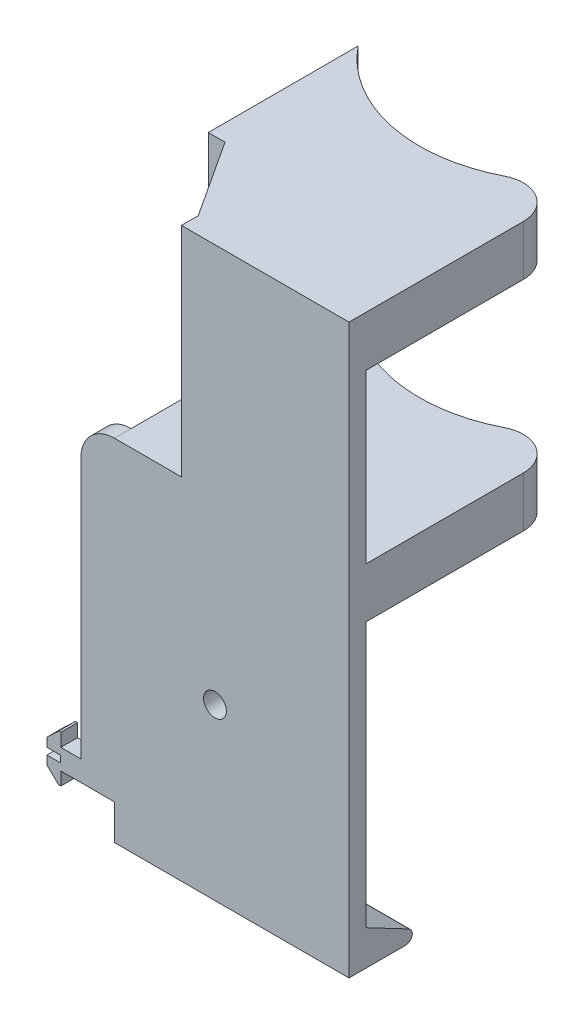
ISO-10303-21;
HEADER;
FILE_DESCRIPTION(('STEP AP214'),'2;1');
FILE_NAME('part.step','',(''),(''),'','','');
FILE_SCHEMA(('AUTOMOTIVE_DESIGN { 1 0 10303 214 1 1 1 1 }'));
ENDSEC;
DATA;
#1=APPLICATION_CONTEXT('core data for automotive mechanical design processes');
#2=APPLICATION_PROTOCOL_DEFINITION('international standard','automotive_design',2000,#1);
#3=PRODUCT_CONTEXT('',#1,'mechanical');
#4=PRODUCT('Part','Part','',(#3));
#5=PRODUCT_RELATED_PRODUCT_CATEGORY('part','',(#4));
#6=PRODUCT_DEFINITION_FORMATION('','',#4);
#7=PRODUCT_DEFINITION_CONTEXT('part definition',#1,'design');
#8=PRODUCT_DEFINITION('design','',#6,#7);
#9=PRODUCT_DEFINITION_SHAPE('','',#8);
#10=(LENGTH_UNIT() NAMED_UNIT(*) SI_UNIT(.MILLI.,.METRE.));
#11=(NAMED_UNIT(*) PLANE_ANGLE_UNIT() SI_UNIT($,.RADIAN.));
#12=(NAMED_UNIT(*) SI_UNIT($,.STERADIAN.) SOLID_ANGLE_UNIT());
#13=UNCERTAINTY_MEASURE_WITH_UNIT(LENGTH_MEASURE(1.E-05),#10,'distance_accuracy_value','');
#14=(GEOMETRIC_REPRESENTATION_CONTEXT(3) GLOBAL_UNCERTAINTY_ASSIGNED_CONTEXT((#13)) GLOBAL_UNIT_ASSIGNED_CONTEXT((#10,
#11,#12)) REPRESENTATION_CONTEXT('',''));
#15=CARTESIAN_POINT('',(0.,0.,0.));
#16=DIRECTION('',(0.,0.,1.));
#17=DIRECTION('',(1.,0.,0.));
#18=AXIS2_PLACEMENT_3D('',#15,#16,#17);
#19=CARTESIAN_POINT('',(0.,0.,-5.));
#20=DIRECTION('',(0.,0.,1.));
#21=DIRECTION('',(1.,0.,0.));
#22=AXIS2_PLACEMENT_3D('',#19,#20,#21);
#23=PLANE('',#22);
#24=DIRECTION('',(-1.,0.,0.));
#25=VECTOR('',#24,1.);
#26=CARTESIAN_POINT('',(95.0000000000001,140.95,-5.));
#27=LINE('',#26,#25);
#28=CARTESIAN_POINT('',(85.0000000000001,140.95,-5.));
#29=VERTEX_POINT('',#28);
#30=CARTESIAN_POINT('',(35.0000000000001,140.95,-5.));
#31=VERTEX_POINT('',#30);
#32=EDGE_CURVE('E318',#29,#31,#27,.T.);
#33=ORIENTED_EDGE('',*,*,#32,.F.);
#34=DIRECTION('',(0.,-1.,0.));
#35=VECTOR('',#34,1.);
#36=CARTESIAN_POINT('',(85.0000000000001,0.,-5.));
#37=LINE('',#36,#35);
#38=CARTESIAN_POINT('',(85.0000000000001,90.95,-5.));
#39=VERTEX_POINT('',#38);
#40=EDGE_CURVE('E543',#29,#39,#37,.T.);
#41=ORIENTED_EDGE('',*,*,#40,.T.);
#42=DIRECTION('',(-1.,0.,0.));
#43=VECTOR('',#42,1.);
#44=CARTESIAN_POINT('',(95.0000000000001,90.95,-4.99999999999999));
#45=LINE('',#44,#43);
#46=CARTESIAN_POINT('',(35.0000000000001,90.95,-5.));
#47=VERTEX_POINT('',#46);
#48=EDGE_CURVE('E319',#39,#47,#45,.T.);
#49=ORIENTED_EDGE('',*,*,#48,.T.);
#50=DIRECTION('',(0.,1.,0.));
#51=VECTOR('',#50,1.);
#52=CARTESIAN_POINT('',(35.0000000000001,90.95,-5.));
#53=LINE('',#52,#51);
#54=EDGE_CURVE('E308',#47,#31,#53,.T.);
#55=ORIENTED_EDGE('',*,*,#54,.T.);
#56=EDGE_LOOP('',(#33,#41,#49,#55));
#57=FACE_BOUND('',#56,.T.);
#58=ADVANCED_FACE('F39',(#57),#23,.F.);
#59=CARTESIAN_POINT('',(0.,-3.05,-5.));
#60=DIRECTION('',(0.,-1.,0.));
#61=DIRECTION('',(1.,0.,0.));
#62=AXIS2_PLACEMENT_3D('',#59,#60,#61);
#63=PLANE('',#62);
#64=DIRECTION('',(1.,0.,0.));
#65=VECTOR('',#64,1.);
#66=CARTESIAN_POINT('',(0.,-3.05,-5.));
#67=LINE('',#66,#65);
#68=CARTESIAN_POINT('',(-0.999999999999957,-3.05,-5.));
#69=VERTEX_POINT('',#68);
#70=CARTESIAN_POINT('',(15.0000000000001,-3.05,-5.));
#71=VERTEX_POINT('',#70);
#72=EDGE_CURVE('E387',#69,#71,#67,.T.);
#73=ORIENTED_EDGE('',*,*,#72,.T.);
#74=DIRECTION('',(0.,0.,-1.));
#75=VECTOR('',#74,1.);
#76=CARTESIAN_POINT('',(15.0000000000001,-3.05,0.));
#77=LINE('',#76,#75);
#78=CARTESIAN_POINT('',(15.0000000000001,-3.05,0.));
#79=VERTEX_POINT('',#78);
#80=EDGE_CURVE('E278',#79,#71,#77,.T.);
#81=ORIENTED_EDGE('',*,*,#80,.F.);
#82=DIRECTION('',(1.,0.,0.));
#83=VECTOR('',#82,1.);
#84=CARTESIAN_POINT('',(0.,-3.05,0.));
#85=LINE('',#84,#83);
#86=CARTESIAN_POINT('',(-0.999999999999957,-3.05,0.));
#87=VERTEX_POINT('',#86);
#88=EDGE_CURVE('E416',#87,#79,#85,.T.);
#89=ORIENTED_EDGE('',*,*,#88,.F.);
#90=DIRECTION('',(0.,0.,1.));
#91=VECTOR('',#90,1.);
#92=CARTESIAN_POINT('',(-0.999999999999957,-3.05,-5.));
#93=LINE('',#92,#91);
#94=EDGE_CURVE('E413',#69,#87,#93,.T.);
#95=ORIENTED_EDGE('',*,*,#94,.F.);
#96=EDGE_LOOP('',(#73,#81,#89,#95));
#97=FACE_BOUND('',#96,.T.);
#98=ADVANCED_FACE('F555',(#97),#63,.T.);
#99=CARTESIAN_POINT('',(45.0000000000009,37.0768697603299,-5.));
#100=DIRECTION('',(0.,0.,-1.));
#101=DIRECTION('',(-1.,0.,0.));
#102=AXIS2_PLACEMENT_3D('',#99,#100,#101);
#103=CIRCLE('',#102,3.4);
#104=CARTESIAN_POINT('',(41.6000000000009,37.0768697603299,-5.));
#105=VERTEX_POINT('',#104);
#106=EDGE_CURVE('E576',#105,#105,#103,.T.);
#107=ORIENTED_EDGE('',*,*,#106,.F.);
#108=EDGE_LOOP('',(#107));
#109=FACE_BOUND('',#108,.T.);
#110=DIRECTION('',(-1.,0.,0.));
#111=VECTOR('',#110,1.);
#112=CARTESIAN_POINT('',(0.,75.95,-5.));
#113=LINE('',#112,#111);
#114=CARTESIAN_POINT('',(85.0000000000001,75.95,-5.));
#115=VERTEX_POINT('',#114);
#116=CARTESIAN_POINT('',(15.0000000000001,75.95,-5.));
#117=VERTEX_POINT('',#116);
#118=EDGE_CURVE('E367',#115,#117,#113,.T.);
#119=ORIENTED_EDGE('',*,*,#118,.F.);
#120=CARTESIAN_POINT('',(85.0000000000001,-3.05000000000001,-5.));
#121=VERTEX_POINT('',#120);
#122=EDGE_CURVE('E506',#115,#121,#37,.T.);
#123=ORIENTED_EDGE('',*,*,#122,.T.);
#124=DIRECTION('',(-1.,0.,0.));
#125=VECTOR('',#124,1.);
#126=CARTESIAN_POINT('',(117.588713996153,-3.05000000000001,-5.));
#127=LINE('',#126,#125);
#128=EDGE_CURVE('E282',#121,#71,#127,.T.);
#129=ORIENTED_EDGE('',*,*,#128,.T.);
#130=ORIENTED_EDGE('',*,*,#72,.F.);
#131=DIRECTION('',(0.,1.,0.));
#132=VECTOR('',#131,1.);
#133=CARTESIAN_POINT('',(-0.999999999999989,0.,-5.));
#134=LINE('',#133,#132);
#135=CARTESIAN_POINT('',(-0.999999999999916,-6.95,-5.));
#136=VERTEX_POINT('',#135);
#137=EDGE_CURVE('E384',#136,#69,#134,.T.);
#138=ORIENTED_EDGE('',*,*,#137,.F.);
#139=DIRECTION('',(1.,0.,0.));
#140=VECTOR('',#139,1.);
#141=CARTESIAN_POINT('',(0.,-6.95,-5.));
#142=LINE('',#141,#140);
#143=CARTESIAN_POINT('',(-1.64108021115414,-6.95,-5.));
#144=VERTEX_POINT('',#143);
#145=EDGE_CURVE('E410',#144,#136,#142,.T.);
#146=ORIENTED_EDGE('',*,*,#145,.F.);
#147=DIRECTION('',(0.725421588273721,-0.68830481566413,0.));
#148=VECTOR('',#147,1.);
#149=CARTESIAN_POINT('',(-4.24769658577378,-4.47675322565298,-5.));
#150=LINE('',#149,#148);
#151=CARTESIAN_POINT('',(-5.15241498392364,-3.61832546401389,-5.));
#152=VERTEX_POINT('',#151);
#153=EDGE_CURVE('E407',#152,#144,#150,.T.);
#154=ORIENTED_EDGE('',*,*,#153,.F.);
#155=DIRECTION('',(0.,1.,0.));
#156=VECTOR('',#155,1.);
#157=CARTESIAN_POINT('',(-5.15241498392368,0.,-5.));
#158=LINE('',#157,#156);
#159=CARTESIAN_POINT('',(-5.15241498392366,-1.00000000000006,-5.));
#160=VERTEX_POINT('',#159);
#161=EDGE_CURVE('E404',#152,#160,#158,.T.);
#162=ORIENTED_EDGE('',*,*,#161,.T.);
#163=DIRECTION('',(1.,0.,0.));
#164=VECTOR('',#163,1.);
#165=CARTESIAN_POINT('',(0.,-1.00000000000006,-5.));
#166=LINE('',#165,#164);
#167=CARTESIAN_POINT('',(-1.15241498392369,-1.00000000000006,-5.));
#168=VERTEX_POINT('',#167);
#169=EDGE_CURVE('E357',#160,#168,#166,.T.);
#170=ORIENTED_EDGE('',*,*,#169,.T.);
#171=DIRECTION('',(0.,1.,0.));
#172=VECTOR('',#171,1.);
#173=CARTESIAN_POINT('',(-1.15241498392369,0.,-5.));
#174=LINE('',#173,#172);
#175=CARTESIAN_POINT('',(-1.15241498392369,0.999999999999944,-5.));
#176=VERTEX_POINT('',#175);
#177=EDGE_CURVE('E344',#168,#176,#174,.T.);
#178=ORIENTED_EDGE('',*,*,#177,.T.);
#179=DIRECTION('',(-1.,0.,0.));
#180=VECTOR('',#179,1.);
#181=CARTESIAN_POINT('',(0.,0.999999999999944,-5.));
#182=LINE('',#181,#180);
#183=CARTESIAN_POINT('',(-5.15241498392369,0.999999999999943,-5.));
#184=VERTEX_POINT('',#183);
#185=EDGE_CURVE('E354',#176,#184,#182,.T.);
#186=ORIENTED_EDGE('',*,*,#185,.T.);
#187=CARTESIAN_POINT('',(-5.15241498392371,3.61832546401378,-5.));
#188=VERTEX_POINT('',#187);
#189=EDGE_CURVE('E403',#184,#188,#158,.T.);
#190=ORIENTED_EDGE('',*,*,#189,.T.);
#191=DIRECTION('',(0.725421588273706,0.688304815664145,0.));
#192=VECTOR('',#191,1.);
#193=CARTESIAN_POINT('',(-4.24769658577387,4.47675322565289,-5.));
#194=LINE('',#193,#192);
#195=CARTESIAN_POINT('',(-1.64108021115429,6.94999999999997,-5.));
#196=VERTEX_POINT('',#195);
#197=EDGE_CURVE('E401',#188,#196,#194,.T.);
#198=ORIENTED_EDGE('',*,*,#197,.T.);
#199=DIRECTION('',(1.,0.,0.));
#200=VECTOR('',#199,1.);
#201=CARTESIAN_POINT('',(-1.50450167679732E-13,6.95,-5.));
#202=LINE('',#201,#200);
#203=CARTESIAN_POINT('',(-1.00000000000006,6.94999999999998,-5.));
#204=VERTEX_POINT('',#203);
#205=EDGE_CURVE('E399',#196,#204,#202,.T.);
#206=ORIENTED_EDGE('',*,*,#205,.T.);
#207=DIRECTION('',(0.,1.,0.));
#208=VECTOR('',#207,1.);
#209=CARTESIAN_POINT('',(-0.999999999999989,0.,-5.));
#210=LINE('',#209,#208);
#211=CARTESIAN_POINT('',(-1.00000000000002,3.04999999999999,-5.));
#212=VERTEX_POINT('',#211);
#213=EDGE_CURVE('E396',#212,#204,#210,.T.);
#214=ORIENTED_EDGE('',*,*,#213,.F.);
#215=DIRECTION('',(1.,0.,0.));
#216=VECTOR('',#215,1.);
#217=CARTESIAN_POINT('',(0.,3.04999999999998,-5.));
#218=LINE('',#217,#216);
#219=CARTESIAN_POINT('',(5.00000000000008,3.05,-5.));
#220=VERTEX_POINT('',#219);
#221=EDGE_CURVE('E394',#212,#220,#218,.T.);
#222=ORIENTED_EDGE('',*,*,#221,.T.);
#223=DIRECTION('',(0.,1.,0.));
#224=VECTOR('',#223,1.);
#225=CARTESIAN_POINT('',(5.00000000000008,0.,-5.));
#226=LINE('',#225,#224);
#227=CARTESIAN_POINT('',(5.00000000000008,80.95,-5.));
#228=VERTEX_POINT('',#227);
#229=EDGE_CURVE('E391',#220,#228,#226,.T.);
#230=ORIENTED_EDGE('',*,*,#229,.T.);
#231=CARTESIAN_POINT('',(15.0000000000001,80.95,-5.));
#232=DIRECTION('',(0.,0.,1.));
#233=DIRECTION('',(1.,0.,0.));
#234=AXIS2_PLACEMENT_3D('',#231,#232,#233);
#235=CIRCLE('',#234,10.);
#236=CARTESIAN_POINT('',(15.0000000000001,90.95,-5.));
#237=VERTEX_POINT('',#236);
#238=EDGE_CURVE('E480',#228,#237,#235,.F.);
#239=ORIENTED_EDGE('',*,*,#238,.T.);
#240=DIRECTION('',(0.,1.,0.));
#241=VECTOR('',#240,1.);
#242=CARTESIAN_POINT('',(15.0000000000001,75.95,-5.));
#243=LINE('',#242,#241);
#244=EDGE_CURVE('E377',#117,#237,#243,.T.);
#245=ORIENTED_EDGE('',*,*,#244,.F.);
#246=EDGE_LOOP('',(#119,#123,#129,#130,#138,#146,#154,#162,#170,#178,#186,#190,#198,#206,#214,
#222,#230,#239,#245));
#247=FACE_BOUND('',#246,.T.);
#248=ADVANCED_FACE('F557',(#109,#247),#23,.F.);
#249=CARTESIAN_POINT('',(5.00000000000008,0.,-5.));
#250=DIRECTION('',(1.,0.,0.));
#251=DIRECTION('',(0.,0.,-1.));
#252=AXIS2_PLACEMENT_3D('',#249,#250,#251);
#253=PLANE('',#252);
#254=DIRECTION('',(0.,1.,0.));
#255=VECTOR('',#254,1.);
#256=CARTESIAN_POINT('',(5.00000000000008,0.,0.));
#257=LINE('',#256,#255);
#258=CARTESIAN_POINT('',(5.00000000000008,3.05,0.));
#259=VERTEX_POINT('',#258);
#260=CARTESIAN_POINT('',(5.00000000000008,80.95,0.));
#261=VERTEX_POINT('',#260);
#262=EDGE_CURVE('E420',#259,#261,#257,.T.);
#263=ORIENTED_EDGE('',*,*,#262,.T.);
#264=DIRECTION('',(0.,0.,1.));
#265=VECTOR('',#264,1.);
#266=CARTESIAN_POINT('',(5.00000000000008,80.95,-5.));
#267=LINE('',#266,#265);
#268=EDGE_CURVE('E478',#261,#228,#267,.F.);
#269=ORIENTED_EDGE('',*,*,#268,.T.);
#270=ORIENTED_EDGE('',*,*,#229,.F.);
#271=DIRECTION('',(0.,0.,1.));
#272=VECTOR('',#271,1.);
#273=CARTESIAN_POINT('',(5.00000000000008,3.05,-5.));
#274=LINE('',#273,#272);
#275=EDGE_CURVE('E459',#220,#259,#274,.T.);
#276=ORIENTED_EDGE('',*,*,#275,.T.);
#277=EDGE_LOOP('',(#263,#269,#270,#276));
#278=FACE_BOUND('',#277,.T.);
#279=ADVANCED_FACE('F566',(#278),#253,.F.);
#280=CARTESIAN_POINT('',(50.0000000000001,75.95,-101.));
#281=DIRECTION('',(0.,1.,0.));
#282=DIRECTION('',(0.,0.,1.));
#283=AXIS2_PLACEMENT_3D('',#280,#281,#282);
#284=CYLINDRICAL_SURFACE('',#283,45.);
#285=CARTESIAN_POINT('',(50.0000000000001,90.95,-101.));
#286=DIRECTION('',(0.,-1.,0.));
#287=DIRECTION('',(0.,0.,-1.));
#288=AXIS2_PLACEMENT_3D('',#285,#286,#287);
#289=CIRCLE('',#288,45.);
#290=CARTESIAN_POINT('',(15.0000000000001,90.95,-72.7157287525381));
#291=VERTEX_POINT('',#290);
#292=CARTESIAN_POINT('',(70.4545454545455,90.95,-60.9174405726389));
#293=VERTEX_POINT('',#292);
#294=EDGE_CURVE('E331',#291,#293,#289,.F.);
#295=ORIENTED_EDGE('',*,*,#294,.T.);
#296=DIRECTION('',(0.,1.,0.));
#297=VECTOR('',#296,1.);
#298=CARTESIAN_POINT('',(70.4545454545455,75.95,-60.9174405726389));
#299=LINE('',#298,#297);
#300=CARTESIAN_POINT('',(70.4545454545455,75.95,-60.9174405726389));
#301=VERTEX_POINT('',#300);
#302=EDGE_CURVE('E491',#293,#301,#299,.F.);
#303=ORIENTED_EDGE('',*,*,#302,.T.);
#304=CARTESIAN_POINT('',(50.0000000000001,75.95,-101.));
#305=DIRECTION('',(0.,1.,0.));
#306=DIRECTION('',(0.,0.,1.));
#307=AXIS2_PLACEMENT_3D('',#304,#305,#306);
#308=CIRCLE('',#307,45.);
#309=CARTESIAN_POINT('',(15.0000000000001,75.95,-72.7157287525381));
#310=VERTEX_POINT('',#309);
#311=EDGE_CURVE('E361',#310,#301,#308,.T.);
#312=ORIENTED_EDGE('',*,*,#311,.F.);
#313=DIRECTION('',(0.,1.,0.));
#314=VECTOR('',#313,1.);
#315=CARTESIAN_POINT('',(15.0000000000001,75.95,-72.7157287525381));
#316=LINE('',#315,#314);
#317=EDGE_CURVE('E381',#310,#291,#316,.T.);
#318=ORIENTED_EDGE('',*,*,#317,.T.);
#319=EDGE_LOOP('',(#295,#303,#312,#318));
#320=FACE_BOUND('',#319,.T.);
#321=ADVANCED_FACE('F514',(#320),#284,.F.);
#322=CARTESIAN_POINT('',(15.0000000000001,75.95,0.));
#323=DIRECTION('',(-1.,0.,0.));
#324=DIRECTION('',(0.,0.,1.));
#325=AXIS2_PLACEMENT_3D('',#322,#323,#324);
#326=PLANE('',#325);
#327=DIRECTION('',(0.,0.,1.));
#328=VECTOR('',#327,1.);
#329=CARTESIAN_POINT('',(15.0000000000001,90.95,-5.));
#330=LINE('',#329,#328);
#331=EDGE_CURVE('E315',#291,#237,#330,.T.);
#332=ORIENTED_EDGE('',*,*,#331,.F.);
#333=ORIENTED_EDGE('',*,*,#317,.F.);
#334=DIRECTION('',(0.,0.,1.));
#335=VECTOR('',#334,1.);
#336=CARTESIAN_POINT('',(15.0000000000001,75.95,0.));
#337=LINE('',#336,#335);
#338=EDGE_CURVE('E364',#310,#117,#337,.T.);
#339=ORIENTED_EDGE('',*,*,#338,.T.);
#340=ORIENTED_EDGE('',*,*,#244,.T.);
#341=EDGE_LOOP('',(#332,#333,#339,#340));
#342=FACE_BOUND('',#341,.T.);
#343=ADVANCED_FACE('F516',(#342),#326,.T.);
#344=CARTESIAN_POINT('',(-5.15241498392368,0.,-5.));
#345=DIRECTION('',(1.,0.,0.));
#346=DIRECTION('',(0.,1.,0.));
#347=AXIS2_PLACEMENT_3D('',#344,#345,#346);
#348=PLANE('',#347);
#349=DIRECTION('',(0.,1.,0.));
#350=VECTOR('',#349,1.);
#351=CARTESIAN_POINT('',(-5.15241498392368,0.,0.));
#352=LINE('',#351,#350);
#353=CARTESIAN_POINT('',(-5.15241498392364,-3.61832546401389,0.));
#354=VERTEX_POINT('',#353);
#355=CARTESIAN_POINT('',(-5.15241498392366,-1.00000000000006,0.));
#356=VERTEX_POINT('',#355);
#357=EDGE_CURVE('E434',#354,#356,#352,.T.);
#358=ORIENTED_EDGE('',*,*,#357,.T.);
#359=DIRECTION('',(0.,0.,1.));
#360=VECTOR('',#359,1.);
#361=CARTESIAN_POINT('',(-5.15241498392366,-1.00000000000006,-72.7157287525381));
#362=LINE('',#361,#360);
#363=EDGE_CURVE('E342',#160,#356,#362,.T.);
#364=ORIENTED_EDGE('',*,*,#363,.F.);
#365=ORIENTED_EDGE('',*,*,#161,.F.);
#366=DIRECTION('',(0.,0.,1.));
#367=VECTOR('',#366,1.);
#368=CARTESIAN_POINT('',(-5.15241498392364,-3.61832546401389,-5.));
#369=LINE('',#368,#367);
#370=EDGE_CURVE('E447',#152,#354,#369,.T.);
#371=ORIENTED_EDGE('',*,*,#370,.T.);
#372=EDGE_LOOP('',(#358,#364,#365,#371));
#373=FACE_BOUND('',#372,.T.);
#374=ADVANCED_FACE('F618',(#373),#348,.F.);
#375=CARTESIAN_POINT('',(-0.999999999999989,0.,-5.));
#376=DIRECTION('',(1.,0.,0.));
#377=DIRECTION('',(0.,1.,0.));
#378=AXIS2_PLACEMENT_3D('',#375,#376,#377);
#379=PLANE('',#378);
#380=DIRECTION('',(0.,1.,0.));
#381=VECTOR('',#380,1.);
#382=CARTESIAN_POINT('',(-0.999999999999989,0.,0.));
#383=LINE('',#382,#381);
#384=CARTESIAN_POINT('',(-0.999999999999916,-6.95,0.));
#385=VERTEX_POINT('',#384);
#386=EDGE_CURVE('E380',#385,#87,#383,.T.);
#387=ORIENTED_EDGE('',*,*,#386,.F.);
#388=DIRECTION('',(0.,0.,1.));
#389=VECTOR('',#388,1.);
#390=CARTESIAN_POINT('',(-0.999999999999916,-6.95,-5.));
#391=LINE('',#390,#389);
#392=EDGE_CURVE('E442',#136,#385,#391,.T.);
#393=ORIENTED_EDGE('',*,*,#392,.F.);
#394=ORIENTED_EDGE('',*,*,#137,.T.);
#395=ORIENTED_EDGE('',*,*,#94,.T.);
#396=EDGE_LOOP('',(#387,#393,#394,#395));
#397=FACE_BOUND('',#396,.T.);
#398=ADVANCED_FACE('F630',(#397),#379,.T.);
#399=CARTESIAN_POINT('',(0.,-6.95,-5.));
#400=DIRECTION('',(0.,-1.,0.));
#401=DIRECTION('',(0.,0.,-1.));
#402=AXIS2_PLACEMENT_3D('',#399,#400,#401);
#403=PLANE('',#402);
#404=DIRECTION('',(1.,0.,0.));
#405=VECTOR('',#404,1.);
#406=CARTESIAN_POINT('',(0.,-6.95,0.));
#407=LINE('',#406,#405);
#408=CARTESIAN_POINT('',(-1.64108021115414,-6.95,0.));
#409=VERTEX_POINT('',#408);
#410=EDGE_CURVE('E388',#409,#385,#407,.T.);
#411=ORIENTED_EDGE('',*,*,#410,.F.);
#412=DIRECTION('',(0.,0.,1.));
#413=VECTOR('',#412,1.);
#414=CARTESIAN_POINT('',(-1.64108021115414,-6.95,-5.));
#415=LINE('',#414,#413);
#416=EDGE_CURVE('E445',#144,#409,#415,.T.);
#417=ORIENTED_EDGE('',*,*,#416,.F.);
#418=ORIENTED_EDGE('',*,*,#145,.T.);
#419=ORIENTED_EDGE('',*,*,#392,.T.);
#420=EDGE_LOOP('',(#411,#417,#418,#419));
#421=FACE_BOUND('',#420,.T.);
#422=ADVANCED_FACE('F626',(#421),#403,.T.);
#423=CARTESIAN_POINT('',(-4.24769658577378,-4.47675322565298,-5.));
#424=DIRECTION('',(-0.68830481566413,-0.725421588273721,0.));
#425=DIRECTION('',(0.725421588273721,-0.68830481566413,0.));
#426=AXIS2_PLACEMENT_3D('',#423,#424,#425);
#427=PLANE('',#426);
#428=DIRECTION('',(0.725421588273721,-0.68830481566413,0.));
#429=VECTOR('',#428,1.);
#430=CARTESIAN_POINT('',(-4.24769658577378,-4.47675322565298,0.));
#431=LINE('',#430,#429);
#432=EDGE_CURVE('E437',#354,#409,#431,.T.);
#433=ORIENTED_EDGE('',*,*,#432,.F.);
#434=ORIENTED_EDGE('',*,*,#370,.F.);
#435=ORIENTED_EDGE('',*,*,#153,.T.);
#436=ORIENTED_EDGE('',*,*,#416,.T.);
#437=EDGE_LOOP('',(#433,#434,#435,#436));
#438=FACE_BOUND('',#437,.T.);
#439=ADVANCED_FACE('F622',(#438),#427,.T.);
#440=ORIENTED_EDGE('',*,*,#189,.F.);
#441=DIRECTION('',(0.,0.,1.));
#442=VECTOR('',#441,1.);
#443=CARTESIAN_POINT('',(-5.15241498392369,0.999999999999943,-72.7157287525381));
#444=LINE('',#443,#442);
#445=CARTESIAN_POINT('',(-5.15241498392369,0.999999999999943,0.));
#446=VERTEX_POINT('',#445);
#447=EDGE_CURVE('E345',#184,#446,#444,.T.);
#448=ORIENTED_EDGE('',*,*,#447,.T.);
#449=CARTESIAN_POINT('',(-5.15241498392371,3.61832546401378,0.));
#450=VERTEX_POINT('',#449);
#451=EDGE_CURVE('E433',#446,#450,#352,.T.);
#452=ORIENTED_EDGE('',*,*,#451,.T.);
#453=DIRECTION('',(0.,0.,1.));
#454=VECTOR('',#453,1.);
#455=CARTESIAN_POINT('',(-5.15241498392371,3.61832546401378,-5.));
#456=LINE('',#455,#454);
#457=EDGE_CURVE('E449',#188,#450,#456,.T.);
#458=ORIENTED_EDGE('',*,*,#457,.F.);
#459=EDGE_LOOP('',(#440,#448,#452,#458));
#460=FACE_BOUND('',#459,.T.);
#461=ADVANCED_FACE('F603',(#460),#348,.F.);
#462=CARTESIAN_POINT('',(-4.24769658577387,4.47675322565289,-5.));
#463=DIRECTION('',(0.688304815664145,-0.725421588273706,0.));
#464=DIRECTION('',(0.725421588273706,0.688304815664145,0.));
#465=AXIS2_PLACEMENT_3D('',#462,#463,#464);
#466=PLANE('',#465);
#467=DIRECTION('',(0.725421588273706,0.688304815664145,0.));
#468=VECTOR('',#467,1.);
#469=CARTESIAN_POINT('',(-4.24769658577387,4.47675322565289,0.));
#470=LINE('',#469,#468);
#471=CARTESIAN_POINT('',(-1.64108021115429,6.94999999999997,0.));
#472=VERTEX_POINT('',#471);
#473=EDGE_CURVE('E431',#450,#472,#470,.T.);
#474=ORIENTED_EDGE('',*,*,#473,.T.);
#475=DIRECTION('',(0.,0.,1.));
#476=VECTOR('',#475,1.);
#477=CARTESIAN_POINT('',(-1.64108021115429,6.94999999999997,-5.));
#478=LINE('',#477,#476);
#479=EDGE_CURVE('E452',#196,#472,#478,.T.);
#480=ORIENTED_EDGE('',*,*,#479,.F.);
#481=ORIENTED_EDGE('',*,*,#197,.F.);
#482=ORIENTED_EDGE('',*,*,#457,.T.);
#483=EDGE_LOOP('',(#474,#480,#481,#482));
#484=FACE_BOUND('',#483,.T.);
#485=ADVANCED_FACE('F598',(#484),#466,.F.);
#486=CARTESIAN_POINT('',(-1.50450167679732E-13,6.95,-5.));
#487=DIRECTION('',(0.,-1.,0.));
#488=DIRECTION('',(1.,0.,0.));
#489=AXIS2_PLACEMENT_3D('',#486,#487,#488);
#490=PLANE('',#489);
#491=DIRECTION('',(1.,0.,0.));
#492=VECTOR('',#491,1.);
#493=CARTESIAN_POINT('',(-1.50450167679732E-13,6.95,0.));
#494=LINE('',#493,#492);
#495=CARTESIAN_POINT('',(-1.00000000000006,6.94999999999998,0.));
#496=VERTEX_POINT('',#495);
#497=EDGE_CURVE('E428',#472,#496,#494,.T.);
#498=ORIENTED_EDGE('',*,*,#497,.T.);
#499=DIRECTION('',(0.,0.,1.));
#500=VECTOR('',#499,1.);
#501=CARTESIAN_POINT('',(-1.00000000000006,6.94999999999998,-5.));
#502=LINE('',#501,#500);
#503=EDGE_CURVE('E455',#204,#496,#502,.T.);
#504=ORIENTED_EDGE('',*,*,#503,.F.);
#505=ORIENTED_EDGE('',*,*,#205,.F.);
#506=ORIENTED_EDGE('',*,*,#479,.T.);
#507=EDGE_LOOP('',(#498,#504,#505,#506));
#508=FACE_BOUND('',#507,.T.);
#509=ADVANCED_FACE('F592',(#508),#490,.F.);
#510=CARTESIAN_POINT('',(-0.999999999999989,0.,-5.));
#511=DIRECTION('',(1.,0.,0.));
#512=DIRECTION('',(0.,1.,0.));
#513=AXIS2_PLACEMENT_3D('',#510,#511,#512);
#514=PLANE('',#513);
#515=DIRECTION('',(0.,1.,0.));
#516=VECTOR('',#515,1.);
#517=CARTESIAN_POINT('',(-0.999999999999989,0.,0.));
#518=LINE('',#517,#516);
#519=CARTESIAN_POINT('',(-1.00000000000002,3.04999999999999,0.));
#520=VERTEX_POINT('',#519);
#521=EDGE_CURVE('E425',#520,#496,#518,.T.);
#522=ORIENTED_EDGE('',*,*,#521,.F.);
#523=DIRECTION('',(0.,0.,1.));
#524=VECTOR('',#523,1.);
#525=CARTESIAN_POINT('',(-1.00000000000002,3.04999999999999,-5.));
#526=LINE('',#525,#524);
#527=EDGE_CURVE('E457',#212,#520,#526,.T.);
#528=ORIENTED_EDGE('',*,*,#527,.F.);
#529=ORIENTED_EDGE('',*,*,#213,.T.);
#530=ORIENTED_EDGE('',*,*,#503,.T.);
#531=EDGE_LOOP('',(#522,#528,#529,#530));
#532=FACE_BOUND('',#531,.T.);
#533=ADVANCED_FACE('F586',(#532),#514,.T.);
#534=CARTESIAN_POINT('',(0.,3.04999999999998,-5.));
#535=DIRECTION('',(0.,-1.,0.));
#536=DIRECTION('',(1.,0.,0.));
#537=AXIS2_PLACEMENT_3D('',#534,#535,#536);
#538=PLANE('',#537);
#539=DIRECTION('',(1.,0.,0.));
#540=VECTOR('',#539,1.);
#541=CARTESIAN_POINT('',(0.,3.04999999999998,0.));
#542=LINE('',#541,#540);
#543=EDGE_CURVE('E423',#520,#259,#542,.T.);
#544=ORIENTED_EDGE('',*,*,#543,.T.);
#545=ORIENTED_EDGE('',*,*,#275,.F.);
#546=ORIENTED_EDGE('',*,*,#221,.F.);
#547=ORIENTED_EDGE('',*,*,#527,.T.);
#548=EDGE_LOOP('',(#544,#545,#546,#547));
#549=FACE_BOUND('',#548,.T.);
#550=ADVANCED_FACE('F660',(#549),#538,.F.);
#551=CARTESIAN_POINT('',(0.,155.95,-5.));
#552=DIRECTION('',(0.,-1.,0.));
#553=DIRECTION('',(0.,0.,-1.));
#554=AXIS2_PLACEMENT_3D('',#551,#552,#553);
#555=PLANE('',#554);
#556=DIRECTION('',(0.,0.,1.));
#557=VECTOR('',#556,1.);
#558=CARTESIAN_POINT('',(85.0000000000001,155.95,0.));
#559=LINE('',#558,#557);
#560=CARTESIAN_POINT('',(85.0000000000001,155.95,-52.0102051443365));
#561=VERTEX_POINT('',#560);
#562=CARTESIAN_POINT('',(85.0000000000001,155.95,0.));
#563=VERTEX_POINT('',#562);
#564=EDGE_CURVE('E256',#561,#563,#559,.T.);
#565=ORIENTED_EDGE('',*,*,#564,.F.);
#566=CARTESIAN_POINT('',(75.0000000000001,155.95,-52.0102051443365));
#567=DIRECTION('',(0.,-1.,0.));
#568=DIRECTION('',(0.,0.,-1.));
#569=AXIS2_PLACEMENT_3D('',#566,#567,#568);
#570=CIRCLE('',#569,10.);
#571=CARTESIAN_POINT('',(70.4545454545455,155.95,-60.9174405726389));
#572=VERTEX_POINT('',#571);
#573=EDGE_CURVE('E61',#561,#572,#570,.F.);
#574=ORIENTED_EDGE('',*,*,#573,.T.);
#575=CARTESIAN_POINT('',(50.0000000000001,155.95,-101.));
#576=DIRECTION('',(0.,1.,0.));
#577=DIRECTION('',(0.,0.,1.));
#578=AXIS2_PLACEMENT_3D('',#575,#576,#577);
#579=CIRCLE('',#578,45.);
#580=CARTESIAN_POINT('',(15.0000000000001,155.95,-72.7157287525381));
#581=VERTEX_POINT('',#580);
#582=EDGE_CURVE('E360',#581,#572,#579,.T.);
#583=ORIENTED_EDGE('',*,*,#582,.F.);
#584=DIRECTION('',(0.,0.,1.));
#585=VECTOR('',#584,1.);
#586=CARTESIAN_POINT('',(15.0000000000001,155.95,0.));
#587=LINE('',#586,#585);
#588=CARTESIAN_POINT('',(15.0000000000001,155.95,-28.));
#589=VERTEX_POINT('',#588);
#590=EDGE_CURVE('E373',#581,#589,#587,.T.);
#591=ORIENTED_EDGE('',*,*,#590,.T.);
#592=DIRECTION('',(-1.,0.,0.));
#593=VECTOR('',#592,1.);
#594=CARTESIAN_POINT('',(20.0000000000001,155.95,-28.));
#595=LINE('',#594,#593);
#596=CARTESIAN_POINT('',(20.0000000000001,155.95,-28.));
#597=VERTEX_POINT('',#596);
#598=EDGE_CURVE('E292',#597,#589,#595,.T.);
#599=ORIENTED_EDGE('',*,*,#598,.F.);
#600=DIRECTION('',(-0.546267780546923,0.,-0.837610596838614));
#601=VECTOR('',#600,1.);
#602=CARTESIAN_POINT('',(35.0000000000001,155.95,-5.));
#603=LINE('',#602,#601);
#604=CARTESIAN_POINT('',(35.0000000000001,155.95,-5.));
#605=VERTEX_POINT('',#604);
#606=EDGE_CURVE('E298',#605,#597,#603,.T.);
#607=ORIENTED_EDGE('',*,*,#606,.F.);
#608=DIRECTION('',(0.,0.,-1.));
#609=VECTOR('',#608,1.);
#610=CARTESIAN_POINT('',(35.0000000000001,155.95,0.));
#611=LINE('',#610,#609);
#612=CARTESIAN_POINT('',(35.0000000000001,155.95,0.));
#613=VERTEX_POINT('',#612);
#614=EDGE_CURVE('E288',#613,#605,#611,.T.);
#615=ORIENTED_EDGE('',*,*,#614,.F.);
#616=DIRECTION('',(1.,0.,0.));
#617=VECTOR('',#616,1.);
#618=CARTESIAN_POINT('',(0.,155.95,0.));
#619=LINE('',#618,#617);
#620=EDGE_CURVE('E418',#613,#563,#619,.T.);
#621=ORIENTED_EDGE('',*,*,#620,.T.);
#622=EDGE_LOOP('',(#565,#574,#583,#591,#599,#607,#615,#621));
#623=FACE_BOUND('',#622,.T.);
#624=ADVANCED_FACE('F530',(#623),#555,.F.);
#625=CARTESIAN_POINT('',(0.,0.,0.));
#626=DIRECTION('',(0.,0.,1.));
#627=DIRECTION('',(1.,0.,0.));
#628=AXIS2_PLACEMENT_3D('',#625,#626,#627);
#629=PLANE('',#628);
#630=CARTESIAN_POINT('',(45.0000000000009,37.0768697603299,0.));
#631=DIRECTION('',(0.,0.,-1.));
#632=DIRECTION('',(-1.,0.,0.));
#633=AXIS2_PLACEMENT_3D('',#630,#631,#632);
#634=CIRCLE('',#633,3.4);
#635=CARTESIAN_POINT('',(41.6000000000009,37.0768697603299,0.));
#636=VERTEX_POINT('',#635);
#637=EDGE_CURVE('E271',#636,#636,#634,.T.);
#638=ORIENTED_EDGE('',*,*,#637,.T.);
#639=EDGE_LOOP('',(#638));
#640=FACE_BOUND('',#639,.T.);
#641=DIRECTION('',(0.,1.,0.));
#642=VECTOR('',#641,1.);
#643=CARTESIAN_POINT('',(85.0000000000001,-13.55,0.));
#644=LINE('',#643,#642);
#645=CARTESIAN_POINT('',(85.0000000000001,-13.55,0.));
#646=VERTEX_POINT('',#645);
#647=EDGE_CURVE('E249',#646,#563,#644,.T.);
#648=ORIENTED_EDGE('',*,*,#647,.T.);
#649=ORIENTED_EDGE('',*,*,#620,.F.);
#650=DIRECTION('',(0.,1.,0.));
#651=VECTOR('',#650,1.);
#652=CARTESIAN_POINT('',(35.0000000000001,90.95,0.));
#653=LINE('',#652,#651);
#654=CARTESIAN_POINT('',(35.0000000000001,90.95,0.));
#655=VERTEX_POINT('',#654);
#656=EDGE_CURVE('E295',#655,#613,#653,.T.);
#657=ORIENTED_EDGE('',*,*,#656,.F.);
#658=DIRECTION('',(1.,0.,0.));
#659=VECTOR('',#658,1.);
#660=CARTESIAN_POINT('',(5.00000000000008,90.95,0.));
#661=LINE('',#660,#659);
#662=CARTESIAN_POINT('',(15.0000000000001,90.95,0.));
#663=VERTEX_POINT('',#662);
#664=EDGE_CURVE('E289',#663,#655,#661,.T.);
#665=ORIENTED_EDGE('',*,*,#664,.F.);
#666=CARTESIAN_POINT('',(15.0000000000001,80.95,0.));
#667=DIRECTION('',(0.,0.,1.));
#668=DIRECTION('',(1.,0.,0.));
#669=AXIS2_PLACEMENT_3D('',#666,#667,#668);
#670=CIRCLE('',#669,10.);
#671=EDGE_CURVE('E476',#663,#261,#670,.T.);
#672=ORIENTED_EDGE('',*,*,#671,.T.);
#673=ORIENTED_EDGE('',*,*,#262,.F.);
#674=ORIENTED_EDGE('',*,*,#543,.F.);
#675=ORIENTED_EDGE('',*,*,#521,.T.);
#676=ORIENTED_EDGE('',*,*,#497,.F.);
#677=ORIENTED_EDGE('',*,*,#473,.F.);
#678=ORIENTED_EDGE('',*,*,#451,.F.);
#679=DIRECTION('',(-1.,0.,0.));
#680=VECTOR('',#679,1.);
#681=CARTESIAN_POINT('',(-1.15241498392369,0.999999999999944,0.));
#682=LINE('',#681,#680);
#683=CARTESIAN_POINT('',(-1.15241498392369,0.999999999999944,0.));
#684=VERTEX_POINT('',#683);
#685=EDGE_CURVE('E339',#684,#446,#682,.T.);
#686=ORIENTED_EDGE('',*,*,#685,.F.);
#687=DIRECTION('',(0.,1.,0.));
#688=VECTOR('',#687,1.);
#689=CARTESIAN_POINT('',(-1.15241498392369,-1.00000000000006,0.));
#690=LINE('',#689,#688);
#691=CARTESIAN_POINT('',(-1.15241498392369,-1.00000000000006,0.));
#692=VERTEX_POINT('',#691);
#693=EDGE_CURVE('E336',#692,#684,#690,.T.);
#694=ORIENTED_EDGE('',*,*,#693,.F.);
#695=DIRECTION('',(1.,0.,0.));
#696=VECTOR('',#695,1.);
#697=CARTESIAN_POINT('',(-5.15241498392366,-1.00000000000006,0.));
#698=LINE('',#697,#696);
#699=EDGE_CURVE('E334',#356,#692,#698,.T.);
#700=ORIENTED_EDGE('',*,*,#699,.F.);
#701=ORIENTED_EDGE('',*,*,#357,.F.);
#702=ORIENTED_EDGE('',*,*,#432,.T.);
#703=ORIENTED_EDGE('',*,*,#410,.T.);
#704=ORIENTED_EDGE('',*,*,#386,.T.);
#705=ORIENTED_EDGE('',*,*,#88,.T.);
#706=DIRECTION('',(0.,1.,0.));
#707=VECTOR('',#706,1.);
#708=CARTESIAN_POINT('',(15.0000000000001,-13.55,0.));
#709=LINE('',#708,#707);
#710=CARTESIAN_POINT('',(15.0000000000001,-13.55,0.));
#711=VERTEX_POINT('',#710);
#712=EDGE_CURVE('E275',#711,#79,#709,.T.);
#713=ORIENTED_EDGE('',*,*,#712,.F.);
#714=DIRECTION('',(-1.,0.,0.));
#715=VECTOR('',#714,1.);
#716=CARTESIAN_POINT('',(95.0000000000001,-13.55,0.));
#717=LINE('',#716,#715);
#718=EDGE_CURVE('E267',#646,#711,#717,.T.);
#719=ORIENTED_EDGE('',*,*,#718,.F.);
#720=EDGE_LOOP('',(#648,#649,#657,#665,#672,#673,#674,#675,#676,#677,#678,#686,#694,#700,#701,
#702,#703,#704,#705,#713,#719));
#721=FACE_BOUND('',#720,.T.);
#722=ADVANCED_FACE('F273',(#640,#721),#629,.T.);
#723=ORIENTED_EDGE('',*,*,#582,.T.);
#724=DIRECTION('',(0.,1.,0.));
#725=VECTOR('',#724,1.);
#726=CARTESIAN_POINT('',(70.4545454545455,75.95,-60.9174405726389));
#727=LINE('',#726,#725);
#728=CARTESIAN_POINT('',(70.4545454545455,140.95,-60.9174405726389));
#729=VERTEX_POINT('',#728);
#730=EDGE_CURVE('E47',#572,#729,#727,.F.);
#731=ORIENTED_EDGE('',*,*,#730,.T.);
#732=CARTESIAN_POINT('',(50.0000000000001,140.95,-101.));
#733=DIRECTION('',(0.,1.,0.));
#734=DIRECTION('',(0.,0.,1.));
#735=AXIS2_PLACEMENT_3D('',#732,#733,#734);
#736=CIRCLE('',#735,45.);
#737=CARTESIAN_POINT('',(15.0000000000001,140.95,-72.7157287525381));
#738=VERTEX_POINT('',#737);
#739=EDGE_CURVE('E327',#729,#738,#736,.F.);
#740=ORIENTED_EDGE('',*,*,#739,.T.);
#741=EDGE_CURVE('E371',#738,#581,#316,.T.);
#742=ORIENTED_EDGE('',*,*,#741,.T.);
#743=EDGE_LOOP('',(#723,#731,#740,#742));
#744=FACE_BOUND('',#743,.T.);
#745=ADVANCED_FACE('F655',(#744),#284,.F.);
#746=CARTESIAN_POINT('',(85.0000000000001,75.95,0.));
#747=DIRECTION('',(-1.,0.,0.));
#748=DIRECTION('',(0.,0.,1.));
#749=AXIS2_PLACEMENT_3D('',#746,#747,#748);
#750=PLANE('',#749);
#751=DIRECTION('',(0.,0.,1.));
#752=VECTOR('',#751,1.);
#753=CARTESIAN_POINT('',(85.0000000000001,75.95,0.));
#754=LINE('',#753,#752);
#755=CARTESIAN_POINT('',(85.0000000000001,75.95,-52.0102051443365));
#756=VERTEX_POINT('',#755);
#757=EDGE_CURVE('E369',#756,#115,#754,.T.);
#758=ORIENTED_EDGE('',*,*,#757,.F.);
#759=DIRECTION('',(0.,1.,0.));
#760=VECTOR('',#759,1.);
#761=CARTESIAN_POINT('',(85.0000000000001,75.95,-52.0102051443365));
#762=LINE('',#761,#760);
#763=CARTESIAN_POINT('',(85.0000000000001,90.95,-52.0102051443365));
#764=VERTEX_POINT('',#763);
#765=EDGE_CURVE('E486',#756,#764,#762,.T.);
#766=ORIENTED_EDGE('',*,*,#765,.T.);
#767=DIRECTION('',(0.,0.,1.));
#768=VECTOR('',#767,1.);
#769=CARTESIAN_POINT('',(85.0000000000001,90.95,0.));
#770=LINE('',#769,#768);
#771=EDGE_CURVE('E329',#764,#39,#770,.T.);
#772=ORIENTED_EDGE('',*,*,#771,.T.);
#773=ORIENTED_EDGE('',*,*,#40,.F.);
#774=DIRECTION('',(0.,0.,-1.));
#775=VECTOR('',#774,1.);
#776=CARTESIAN_POINT('',(85.0000000000001,140.95,0.));
#777=LINE('',#776,#775);
#778=CARTESIAN_POINT('',(85.0000000000001,140.95,-52.0102051443365));
#779=VERTEX_POINT('',#778);
#780=EDGE_CURVE('E322',#29,#779,#777,.T.);
#781=ORIENTED_EDGE('',*,*,#780,.T.);
#782=DIRECTION('',(0.,1.,0.));
#783=VECTOR('',#782,1.);
#784=CARTESIAN_POINT('',(85.0000000000001,75.95,-52.0102051443365));
#785=LINE('',#784,#783);
#786=EDGE_CURVE('E484',#779,#561,#785,.T.);
#787=ORIENTED_EDGE('',*,*,#786,.T.);
#788=ORIENTED_EDGE('',*,*,#564,.T.);
#789=ORIENTED_EDGE('',*,*,#647,.F.);
#790=DIRECTION('',(0.,0.,1.));
#791=VECTOR('',#790,1.);
#792=CARTESIAN_POINT('',(85.0000000000001,-13.55,-72.7157287525381));
#793=LINE('',#792,#791);
#794=CARTESIAN_POINT('',(85.0000000000001,-13.55,-16.8878640007328));
#795=VERTEX_POINT('',#794);
#796=EDGE_CURVE('E253',#795,#646,#793,.T.);
#797=ORIENTED_EDGE('',*,*,#796,.F.);
#798=CARTESIAN_POINT('',(85.0000000000001,-11.55,-16.8878640007328));
#799=DIRECTION('',(-1.,0.,0.));
#800=DIRECTION('',(0.,0.,1.));
#801=AXIS2_PLACEMENT_3D('',#798,#799,#800);
#802=CIRCLE('',#801,2.);
#803=CARTESIAN_POINT('',(85.0000000000001,-9.77920419432412,-17.8175317987126));
#804=VERTEX_POINT('',#803);
#805=EDGE_CURVE('E482',#795,#804,#802,.F.);
#806=ORIENTED_EDGE('',*,*,#805,.T.);
#807=DIRECTION('',(0.,0.46483389898992,0.885397902837944));
#808=VECTOR('',#807,1.);
#809=CARTESIAN_POINT('',(85.0000000000001,-3.05000000000001,-5.));
#810=LINE('',#809,#808);
#811=EDGE_CURVE('E261',#804,#121,#810,.T.);
#812=ORIENTED_EDGE('',*,*,#811,.T.);
#813=ORIENTED_EDGE('',*,*,#122,.F.);
#814=EDGE_LOOP('',(#758,#766,#772,#773,#781,#787,#788,#789,#797,#806,#812,#813));
#815=FACE_BOUND('',#814,.T.);
#816=ADVANCED_FACE('F252',(#815),#750,.F.);
#817=DIRECTION('',(0.,1.,0.));
#818=VECTOR('',#817,1.);
#819=CARTESIAN_POINT('',(15.0000000000001,90.95,-28.));
#820=LINE('',#819,#818);
#821=CARTESIAN_POINT('',(15.0000000000001,140.95,-28.));
#822=VERTEX_POINT('',#821);
#823=EDGE_CURVE('E302',#822,#589,#820,.T.);
#824=ORIENTED_EDGE('',*,*,#823,.T.);
#825=ORIENTED_EDGE('',*,*,#590,.F.);
#826=ORIENTED_EDGE('',*,*,#741,.F.);
#827=DIRECTION('',(0.,0.,-1.));
#828=VECTOR('',#827,1.);
#829=CARTESIAN_POINT('',(15.0000000000001,140.95,-5.));
#830=LINE('',#829,#828);
#831=EDGE_CURVE('E305',#822,#738,#830,.T.);
#832=ORIENTED_EDGE('',*,*,#831,.F.);
#833=EDGE_LOOP('',(#824,#825,#826,#832));
#834=FACE_BOUND('',#833,.T.);
#835=ADVANCED_FACE('F847',(#834),#326,.T.);
#836=CARTESIAN_POINT('',(0.,75.95,0.));
#837=DIRECTION('',(0.,1.,0.));
#838=DIRECTION('',(0.,0.,1.));
#839=AXIS2_PLACEMENT_3D('',#836,#837,#838);
#840=PLANE('',#839);
#841=ORIENTED_EDGE('',*,*,#311,.T.);
#842=CARTESIAN_POINT('',(75.0000000000001,75.95,-52.0102051443365));
#843=DIRECTION('',(0.,1.,0.));
#844=DIRECTION('',(0.,0.,1.));
#845=AXIS2_PLACEMENT_3D('',#842,#843,#844);
#846=CIRCLE('',#845,10.);
#847=EDGE_CURVE('E493',#301,#756,#846,.F.);
#848=ORIENTED_EDGE('',*,*,#847,.T.);
#849=ORIENTED_EDGE('',*,*,#757,.T.);
#850=ORIENTED_EDGE('',*,*,#118,.T.);
#851=ORIENTED_EDGE('',*,*,#338,.F.);
#852=EDGE_LOOP('',(#841,#848,#849,#850,#851));
#853=FACE_BOUND('',#852,.T.);
#854=ADVANCED_FACE('F497',(#853),#840,.F.);
#855=CARTESIAN_POINT('',(-5.15241498392366,-1.00000000000006,-72.7157287525381));
#856=DIRECTION('',(0.,-1.,0.));
#857=DIRECTION('',(0.,0.,-1.));
#858=AXIS2_PLACEMENT_3D('',#855,#856,#857);
#859=PLANE('',#858);
#860=ORIENTED_EDGE('',*,*,#363,.T.);
#861=ORIENTED_EDGE('',*,*,#699,.T.);
#862=DIRECTION('',(0.,0.,1.));
#863=VECTOR('',#862,1.);
#864=CARTESIAN_POINT('',(-1.15241498392369,-1.00000000000006,-72.7157287525381));
#865=LINE('',#864,#863);
#866=EDGE_CURVE('E341',#168,#692,#865,.T.);
#867=ORIENTED_EDGE('',*,*,#866,.F.);
#868=ORIENTED_EDGE('',*,*,#169,.F.);
#869=EDGE_LOOP('',(#860,#861,#867,#868));
#870=FACE_BOUND('',#869,.T.);
#871=ADVANCED_FACE('F612',(#870),#859,.F.);
#872=CARTESIAN_POINT('',(-1.15241498392369,0.999999999999944,-72.7157287525381));
#873=DIRECTION('',(0.,1.,0.));
#874=DIRECTION('',(-1.,0.,0.));
#875=AXIS2_PLACEMENT_3D('',#872,#873,#874);
#876=PLANE('',#875);
#877=DIRECTION('',(0.,0.,1.));
#878=VECTOR('',#877,1.);
#879=CARTESIAN_POINT('',(-1.15241498392369,0.999999999999944,-72.7157287525381));
#880=LINE('',#879,#878);
#881=EDGE_CURVE('E348',#176,#684,#880,.T.);
#882=ORIENTED_EDGE('',*,*,#881,.T.);
#883=ORIENTED_EDGE('',*,*,#685,.T.);
#884=ORIENTED_EDGE('',*,*,#447,.F.);
#885=ORIENTED_EDGE('',*,*,#185,.F.);
#886=EDGE_LOOP('',(#882,#883,#884,#885));
#887=FACE_BOUND('',#886,.T.);
#888=ADVANCED_FACE('F605',(#887),#876,.F.);
#889=CARTESIAN_POINT('',(-1.15241498392369,-1.00000000000006,-72.7157287525381));
#890=DIRECTION('',(1.,0.,0.));
#891=DIRECTION('',(0.,0.,-1.));
#892=AXIS2_PLACEMENT_3D('',#889,#890,#891);
#893=PLANE('',#892);
#894=ORIENTED_EDGE('',*,*,#866,.T.);
#895=ORIENTED_EDGE('',*,*,#693,.T.);
#896=ORIENTED_EDGE('',*,*,#881,.F.);
#897=ORIENTED_EDGE('',*,*,#177,.F.);
#898=EDGE_LOOP('',(#894,#895,#896,#897));
#899=FACE_BOUND('',#898,.T.);
#900=ADVANCED_FACE('F609',(#899),#893,.F.);
#901=CARTESIAN_POINT('',(95.0000000000001,90.95,-4.99999999999999));
#902=DIRECTION('',(0.,-1.,0.));
#903=DIRECTION('',(0.,0.,-1.));
#904=AXIS2_PLACEMENT_3D('',#901,#902,#903);
#905=PLANE('',#904);
#906=ORIENTED_EDGE('',*,*,#771,.F.);
#907=CARTESIAN_POINT('',(75.0000000000001,90.95,-52.0102051443365));
#908=DIRECTION('',(0.,-1.,0.));
#909=DIRECTION('',(0.,0.,-1.));
#910=AXIS2_PLACEMENT_3D('',#907,#908,#909);
#911=CIRCLE('',#910,10.);
#912=EDGE_CURVE('E489',#764,#293,#911,.F.);
#913=ORIENTED_EDGE('',*,*,#912,.T.);
#914=ORIENTED_EDGE('',*,*,#294,.F.);
#915=ORIENTED_EDGE('',*,*,#331,.T.);
#916=DIRECTION('',(0.,0.,1.));
#917=VECTOR('',#916,1.);
#918=CARTESIAN_POINT('',(15.0000000000001,90.95,-4.99999999999999));
#919=LINE('',#918,#917);
#920=EDGE_CURVE('E473',#237,#663,#919,.T.);
#921=ORIENTED_EDGE('',*,*,#920,.T.);
#922=ORIENTED_EDGE('',*,*,#664,.T.);
#923=DIRECTION('',(0.,0.,-1.));
#924=VECTOR('',#923,1.);
#925=CARTESIAN_POINT('',(35.0000000000001,90.95,0.));
#926=LINE('',#925,#924);
#927=EDGE_CURVE('E291',#655,#47,#926,.T.);
#928=ORIENTED_EDGE('',*,*,#927,.T.);
#929=ORIENTED_EDGE('',*,*,#48,.F.);
#930=EDGE_LOOP('',(#906,#913,#914,#915,#921,#922,#928,#929));
#931=FACE_BOUND('',#930,.T.);
#932=ADVANCED_FACE('F510',(#931),#905,.F.);
#933=CARTESIAN_POINT('',(95.0000000000001,140.95,-5.));
#934=DIRECTION('',(0.,1.,0.));
#935=DIRECTION('',(0.,0.,1.));
#936=AXIS2_PLACEMENT_3D('',#933,#934,#935);
#937=PLANE('',#936);
#938=ORIENTED_EDGE('',*,*,#739,.F.);
#939=CARTESIAN_POINT('',(75.0000000000001,140.95,-52.0102051443365));
#940=DIRECTION('',(0.,1.,0.));
#941=DIRECTION('',(0.,0.,1.));
#942=AXIS2_PLACEMENT_3D('',#939,#940,#941);
#943=CIRCLE('',#942,10.);
#944=EDGE_CURVE('E11',#729,#779,#943,.F.);
#945=ORIENTED_EDGE('',*,*,#944,.T.);
#946=ORIENTED_EDGE('',*,*,#780,.F.);
#947=ORIENTED_EDGE('',*,*,#32,.T.);
#948=DIRECTION('',(-0.546267780546923,0.,-0.837610596838614));
#949=VECTOR('',#948,1.);
#950=CARTESIAN_POINT('',(52.9045092838197,140.95,22.4535809018568));
#951=LINE('',#950,#949);
#952=CARTESIAN_POINT('',(20.0000000000001,140.95,-28.));
#953=VERTEX_POINT('',#952);
#954=EDGE_CURVE('E444',#31,#953,#951,.T.);
#955=ORIENTED_EDGE('',*,*,#954,.T.);
#956=DIRECTION('',(-1.,0.,0.));
#957=VECTOR('',#956,1.);
#958=CARTESIAN_POINT('',(95.0000000000001,140.95,-28.0000000000001));
#959=LINE('',#958,#957);
#960=EDGE_CURVE('E465',#953,#822,#959,.T.);
#961=ORIENTED_EDGE('',*,*,#960,.T.);
#962=ORIENTED_EDGE('',*,*,#831,.T.);
#963=EDGE_LOOP('',(#938,#945,#946,#947,#955,#961,#962));
#964=FACE_BOUND('',#963,.T.);
#965=ADVANCED_FACE('F540',(#964),#937,.F.);
#966=CARTESIAN_POINT('',(20.0000000000001,90.95,-28.));
#967=DIRECTION('',(0.,0.,-1.));
#968=DIRECTION('',(-1.,0.,0.));
#969=AXIS2_PLACEMENT_3D('',#966,#967,#968);
#970=PLANE('',#969);
#971=DIRECTION('',(0.,1.,0.));
#972=VECTOR('',#971,1.);
#973=CARTESIAN_POINT('',(20.0000000000001,90.95,-28.));
#974=LINE('',#973,#972);
#975=EDGE_CURVE('E306',#953,#597,#974,.T.);
#976=ORIENTED_EDGE('',*,*,#975,.T.);
#977=ORIENTED_EDGE('',*,*,#598,.T.);
#978=ORIENTED_EDGE('',*,*,#823,.F.);
#979=ORIENTED_EDGE('',*,*,#960,.F.);
#980=EDGE_LOOP('',(#976,#977,#978,#979));
#981=FACE_BOUND('',#980,.T.);
#982=ADVANCED_FACE('F792',(#981),#970,.F.);
#983=CARTESIAN_POINT('',(35.0000000000001,90.95,-5.));
#984=DIRECTION('',(0.837610596838614,0.,-0.546267780546923));
#985=DIRECTION('',(-0.546267780546923,0.,-0.837610596838614));
#986=AXIS2_PLACEMENT_3D('',#983,#984,#985);
#987=PLANE('',#986);
#988=EDGE_CURVE('E311',#31,#605,#53,.T.);
#989=ORIENTED_EDGE('',*,*,#988,.T.);
#990=ORIENTED_EDGE('',*,*,#606,.T.);
#991=ORIENTED_EDGE('',*,*,#975,.F.);
#992=ORIENTED_EDGE('',*,*,#954,.F.);
#993=EDGE_LOOP('',(#989,#990,#991,#992));
#994=FACE_BOUND('',#993,.T.);
#995=ADVANCED_FACE('F533',(#994),#987,.F.);
#996=CARTESIAN_POINT('',(35.0000000000001,90.95,0.));
#997=DIRECTION('',(1.,0.,0.));
#998=DIRECTION('',(0.,0.,-1.));
#999=AXIS2_PLACEMENT_3D('',#996,#997,#998);
#1000=PLANE('',#999);
#1001=ORIENTED_EDGE('',*,*,#614,.T.);
#1002=ORIENTED_EDGE('',*,*,#988,.F.);
#1003=ORIENTED_EDGE('',*,*,#54,.F.);
#1004=ORIENTED_EDGE('',*,*,#927,.F.);
#1005=ORIENTED_EDGE('',*,*,#656,.T.);
#1006=EDGE_LOOP('',(#1001,#1002,#1003,#1004,#1005));
#1007=FACE_BOUND('',#1006,.T.);
#1008=ADVANCED_FACE('F527',(#1007),#1000,.F.);
#1009=CARTESIAN_POINT('',(15.0000000000001,-13.55,0.));
#1010=DIRECTION('',(1.,0.,0.));
#1011=DIRECTION('',(0.,1.,0.));
#1012=AXIS2_PLACEMENT_3D('',#1009,#1010,#1011);
#1013=PLANE('',#1012);
#1014=DIRECTION('',(0.,-0.46483389898992,-0.885397902837944));
#1015=VECTOR('',#1014,1.);
#1016=CARTESIAN_POINT('',(15.0000000000001,-3.05,-5.));
#1017=LINE('',#1016,#1015);
#1018=CARTESIAN_POINT('',(15.0000000000001,-9.77920419432412,-17.8175317987126));
#1019=VERTEX_POINT('',#1018);
#1020=EDGE_CURVE('E638',#71,#1019,#1017,.T.);
#1021=ORIENTED_EDGE('',*,*,#1020,.T.);
#1022=CARTESIAN_POINT('',(15.0000000000001,-11.55,-16.8878640007328));
#1023=DIRECTION('',(1.,0.,0.));
#1024=DIRECTION('',(0.,1.,0.));
#1025=AXIS2_PLACEMENT_3D('',#1022,#1023,#1024);
#1026=CIRCLE('',#1025,2.);
#1027=CARTESIAN_POINT('',(15.0000000000001,-13.55,-16.8878640007328));
#1028=VERTEX_POINT('',#1027);
#1029=EDGE_CURVE('E470',#1019,#1028,#1026,.F.);
#1030=ORIENTED_EDGE('',*,*,#1029,.T.);
#1031=DIRECTION('',(0.,0.,-1.));
#1032=VECTOR('',#1031,1.);
#1033=CARTESIAN_POINT('',(15.0000000000001,-13.55,0.));
#1034=LINE('',#1033,#1032);
#1035=EDGE_CURVE('E277',#711,#1028,#1034,.T.);
#1036=ORIENTED_EDGE('',*,*,#1035,.F.);
#1037=ORIENTED_EDGE('',*,*,#712,.T.);
#1038=ORIENTED_EDGE('',*,*,#80,.T.);
#1039=EDGE_LOOP('',(#1021,#1030,#1036,#1037,#1038));
#1040=FACE_BOUND('',#1039,.T.);
#1041=ADVANCED_FACE('F636',(#1040),#1013,.F.);
#1042=CARTESIAN_POINT('',(0.,-13.55,0.));
#1043=DIRECTION('',(0.,1.,0.));
#1044=DIRECTION('',(-1.,0.,0.));
#1045=AXIS2_PLACEMENT_3D('',#1042,#1043,#1044);
#1046=PLANE('',#1045);
#1047=DIRECTION('',(-1.,0.,0.));
#1048=VECTOR('',#1047,1.);
#1049=CARTESIAN_POINT('',(95.0000000000001,-13.55,-16.8878640007328));
#1050=LINE('',#1049,#1048);
#1051=EDGE_CURVE('E270',#1028,#795,#1050,.F.);
#1052=ORIENTED_EDGE('',*,*,#1051,.T.);
#1053=ORIENTED_EDGE('',*,*,#796,.T.);
#1054=ORIENTED_EDGE('',*,*,#718,.T.);
#1055=ORIENTED_EDGE('',*,*,#1035,.T.);
#1056=EDGE_LOOP('',(#1052,#1053,#1054,#1055));
#1057=FACE_BOUND('',#1056,.T.);
#1058=ADVANCED_FACE('F265',(#1057),#1046,.F.);
#1059=CARTESIAN_POINT('',(117.588713996153,-3.05000000000001,-5.));
#1060=DIRECTION('',(0.,0.885397902837943,-0.46483389898992));
#1061=DIRECTION('',(0.,0.46483389898992,0.885397902837944));
#1062=AXIS2_PLACEMENT_3D('',#1059,#1060,#1061);
#1063=PLANE('',#1062);
#1064=ORIENTED_EDGE('',*,*,#811,.F.);
#1065=DIRECTION('',(-1.,0.,0.));
#1066=VECTOR('',#1065,1.);
#1067=CARTESIAN_POINT('',(15.0000000000001,-9.77920419432412,-17.8175317987126));
#1068=LINE('',#1067,#1066);
#1069=EDGE_CURVE('E468',#804,#1019,#1068,.T.);
#1070=ORIENTED_EDGE('',*,*,#1069,.T.);
#1071=ORIENTED_EDGE('',*,*,#1020,.F.);
#1072=ORIENTED_EDGE('',*,*,#128,.F.);
#1073=EDGE_LOOP('',(#1064,#1070,#1071,#1072));
#1074=FACE_BOUND('',#1073,.T.);
#1075=ADVANCED_FACE('F645',(#1074),#1063,.T.);
#1076=CARTESIAN_POINT('',(117.588713996153,-11.55,-16.8878640007328));
#1077=DIRECTION('',(1.,0.,0.));
#1078=DIRECTION('',(0.,1.,0.));
#1079=AXIS2_PLACEMENT_3D('',#1076,#1077,#1078);
#1080=CYLINDRICAL_SURFACE('',#1079,2.);
#1081=ORIENTED_EDGE('',*,*,#805,.F.);
#1082=ORIENTED_EDGE('',*,*,#1051,.F.);
#1083=ORIENTED_EDGE('',*,*,#1029,.F.);
#1084=ORIENTED_EDGE('',*,*,#1069,.F.);
#1085=EDGE_LOOP('',(#1081,#1082,#1083,#1084));
#1086=FACE_BOUND('',#1085,.T.);
#1087=ADVANCED_FACE('F641',(#1086),#1080,.T.);
#1088=CARTESIAN_POINT('',(15.0000000000001,80.95,-4.99999999999999));
#1089=DIRECTION('',(0.,0.,1.));
#1090=DIRECTION('',(1.,0.,0.));
#1091=AXIS2_PLACEMENT_3D('',#1088,#1089,#1090);
#1092=CYLINDRICAL_SURFACE('',#1091,10.);
#1093=ORIENTED_EDGE('',*,*,#238,.F.);
#1094=ORIENTED_EDGE('',*,*,#268,.F.);
#1095=ORIENTED_EDGE('',*,*,#671,.F.);
#1096=ORIENTED_EDGE('',*,*,#920,.F.);
#1097=EDGE_LOOP('',(#1093,#1094,#1095,#1096));
#1098=FACE_BOUND('',#1097,.T.);
#1099=ADVANCED_FACE('F553',(#1098),#1092,.T.);
#1100=CARTESIAN_POINT('',(75.0000000000001,75.95,-52.0102051443365));
#1101=DIRECTION('',(0.,1.,0.));
#1102=DIRECTION('',(0.,0.,1.));
#1103=AXIS2_PLACEMENT_3D('',#1100,#1101,#1102);
#1104=CYLINDRICAL_SURFACE('',#1103,10.);
#1105=ORIENTED_EDGE('',*,*,#847,.F.);
#1106=ORIENTED_EDGE('',*,*,#302,.F.);
#1107=ORIENTED_EDGE('',*,*,#912,.F.);
#1108=ORIENTED_EDGE('',*,*,#765,.F.);
#1109=EDGE_LOOP('',(#1105,#1106,#1107,#1108));
#1110=FACE_BOUND('',#1109,.T.);
#1111=ADVANCED_FACE('F508',(#1110),#1104,.T.);
#1112=CARTESIAN_POINT('',(75.0000000000001,75.95,-52.0102051443365));
#1113=DIRECTION('',(0.,1.,0.));
#1114=DIRECTION('',(0.,0.,1.));
#1115=AXIS2_PLACEMENT_3D('',#1112,#1113,#1114);
#1116=CYLINDRICAL_SURFACE('',#1115,10.);
#1117=ORIENTED_EDGE('',*,*,#944,.F.);
#1118=ORIENTED_EDGE('',*,*,#730,.F.);
#1119=ORIENTED_EDGE('',*,*,#573,.F.);
#1120=ORIENTED_EDGE('',*,*,#786,.F.);
#1121=EDGE_LOOP('',(#1117,#1118,#1119,#1120));
#1122=FACE_BOUND('',#1121,.T.);
#1123=ADVANCED_FACE('F41',(#1122),#1116,.T.);
#1124=CARTESIAN_POINT('',(45.0000000000009,37.0768697603299,0.));
#1125=DIRECTION('',(0.,0.,-1.));
#1126=DIRECTION('',(-1.,0.,0.));
#1127=AXIS2_PLACEMENT_3D('',#1124,#1125,#1126);
#1128=CYLINDRICAL_SURFACE('',#1127,3.4);
#1129=ORIENTED_EDGE('',*,*,#637,.F.);
#1130=EDGE_LOOP('',(#1129));
#1131=FACE_BOUND('',#1130,.T.);
#1132=ORIENTED_EDGE('',*,*,#106,.T.);
#1133=EDGE_LOOP('',(#1132));
#1134=FACE_BOUND('',#1133,.T.);
#1135=ADVANCED_FACE('F546',(#1131,#1134),#1128,.F.);
#1136=CLOSED_SHELL('',(#58,#98,#248,#279,#321,#343,#374,#398,#422,#439,#461,#485,#509,#533,#550,
#624,#722,#745,#816,#835,#854,#871,#888,#900,#932,#965,#982,#995,#1008,#1041,#1058,#1075,#1087,
#1099,#1111,#1123,#1135));
#1137=MANIFOLD_SOLID_BREP('B2',#1136);
#1138=ADVANCED_BREP_SHAPE_REPRESENTATION('',(#18,#1137),#14);
#1139=SHAPE_DEFINITION_REPRESENTATION(#9,#1138);
ENDSEC;
END-ISO-10303-21;
